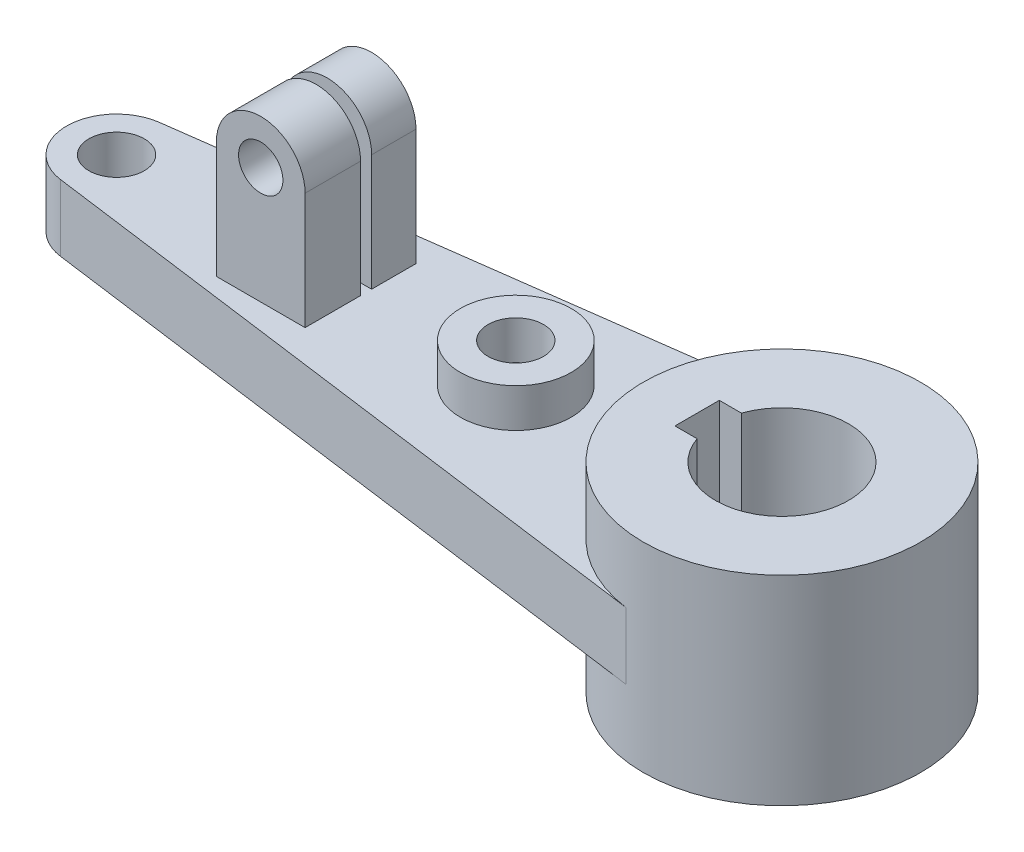
ISO-10303-21;
HEADER;
FILE_DESCRIPTION(('STEP AP214'),'2;1');
FILE_NAME('part.step','',(''),(''),'','','');
FILE_SCHEMA(('AUTOMOTIVE_DESIGN { 1 0 10303 214 1 1 1 1 }'));
ENDSEC;
DATA;
#1=APPLICATION_CONTEXT('core data for automotive mechanical design processes');
#2=APPLICATION_PROTOCOL_DEFINITION('international standard','automotive_design',2000,#1);
#3=PRODUCT_CONTEXT('',#1,'mechanical');
#4=PRODUCT('Part','Part','',(#3));
#5=PRODUCT_RELATED_PRODUCT_CATEGORY('part','',(#4));
#6=PRODUCT_DEFINITION_FORMATION('','',#4);
#7=PRODUCT_DEFINITION_CONTEXT('part definition',#1,'design');
#8=PRODUCT_DEFINITION('design','',#6,#7);
#9=PRODUCT_DEFINITION_SHAPE('','',#8);
#10=(LENGTH_UNIT() NAMED_UNIT(*) SI_UNIT(.MILLI.,.METRE.));
#11=(NAMED_UNIT(*) PLANE_ANGLE_UNIT() SI_UNIT($,.RADIAN.));
#12=(NAMED_UNIT(*) SI_UNIT($,.STERADIAN.) SOLID_ANGLE_UNIT());
#13=UNCERTAINTY_MEASURE_WITH_UNIT(LENGTH_MEASURE(1.E-05),#10,'distance_accuracy_value','');
#14=(GEOMETRIC_REPRESENTATION_CONTEXT(3) GLOBAL_UNCERTAINTY_ASSIGNED_CONTEXT((#13)) GLOBAL_UNIT_ASSIGNED_CONTEXT((#10,
#11,#12)) REPRESENTATION_CONTEXT('',''));
#15=CARTESIAN_POINT('',(0.,0.,0.));
#16=DIRECTION('',(0.,0.,1.));
#17=DIRECTION('',(1.,0.,0.));
#18=AXIS2_PLACEMENT_3D('',#15,#16,#17);
#19=CARTESIAN_POINT('',(-76.,0.,10.));
#20=DIRECTION('',(1.,0.,0.));
#21=DIRECTION('',(0.,0.,-1.));
#22=AXIS2_PLACEMENT_3D('',#19,#20,#21);
#23=PLANE('',#22);
#24=DIRECTION('',(0.,-1.,0.));
#25=VECTOR('',#24,1.);
#26=CARTESIAN_POINT('',(-76.,27.,-2.));
#27=LINE('',#26,#25);
#28=CARTESIAN_POINT('',(-76.,27.,-2.));
#29=VERTEX_POINT('',#28);
#30=CARTESIAN_POINT('',(-76.,6.,-2.));
#31=VERTEX_POINT('',#30);
#32=EDGE_CURVE('E166',#29,#31,#27,.T.);
#33=ORIENTED_EDGE('',*,*,#32,.T.);
#34=DIRECTION('',(0.,0.,-1.));
#35=VECTOR('',#34,1.);
#36=CARTESIAN_POINT('',(-76.,6.,10.));
#37=LINE('',#36,#35);
#38=CARTESIAN_POINT('',(-76.,6.,-10.));
#39=VERTEX_POINT('',#38);
#40=EDGE_CURVE('E71',#31,#39,#37,.T.);
#41=ORIENTED_EDGE('',*,*,#40,.T.);
#42=DIRECTION('',(0.,-1.,0.));
#43=VECTOR('',#42,1.);
#44=CARTESIAN_POINT('',(-76.,0.,-10.));
#45=LINE('',#44,#43);
#46=CARTESIAN_POINT('',(-76.,27.,-10.));
#47=VERTEX_POINT('',#46);
#48=EDGE_CURVE('E355',#47,#39,#45,.T.);
#49=ORIENTED_EDGE('',*,*,#48,.F.);
#50=DIRECTION('',(0.,0.,-1.));
#51=VECTOR('',#50,1.);
#52=CARTESIAN_POINT('',(-76.,27.,10.));
#53=LINE('',#52,#51);
#54=EDGE_CURVE('E174',#29,#47,#53,.T.);
#55=ORIENTED_EDGE('',*,*,#54,.F.);
#56=EDGE_LOOP('',(#33,#41,#49,#55));
#57=FACE_BOUND('',#56,.T.);
#58=ADVANCED_FACE('F45',(#57),#23,.T.);
#59=CARTESIAN_POINT('',(-84.,27.,10.));
#60=DIRECTION('',(0.,0.,-1.));
#61=DIRECTION('',(-1.,0.,0.));
#62=AXIS2_PLACEMENT_3D('',#59,#60,#61);
#63=CYLINDRICAL_SURFACE('',#62,8.);
#64=DIRECTION('',(0.,0.,-1.));
#65=VECTOR('',#64,1.);
#66=CARTESIAN_POINT('',(-92.,27.,10.));
#67=LINE('',#66,#65);
#68=CARTESIAN_POINT('',(-92.,27.,-2.));
#69=VERTEX_POINT('',#68);
#70=CARTESIAN_POINT('',(-92.,27.,-10.));
#71=VERTEX_POINT('',#70);
#72=EDGE_CURVE('E200',#69,#71,#67,.T.);
#73=ORIENTED_EDGE('',*,*,#72,.F.);
#74=CARTESIAN_POINT('',(-84.,27.,-2.));
#75=DIRECTION('',(0.,0.,-1.));
#76=DIRECTION('',(-1.,0.,0.));
#77=AXIS2_PLACEMENT_3D('',#74,#75,#76);
#78=CIRCLE('',#77,8.);
#79=EDGE_CURVE('E334',#69,#29,#78,.T.);
#80=ORIENTED_EDGE('',*,*,#79,.T.);
#81=ORIENTED_EDGE('',*,*,#54,.T.);
#82=CARTESIAN_POINT('',(-84.,27.,-10.));
#83=DIRECTION('',(0.,0.,1.));
#84=DIRECTION('',(1.,0.,0.));
#85=AXIS2_PLACEMENT_3D('',#82,#83,#84);
#86=CIRCLE('',#85,8.);
#87=EDGE_CURVE('E358',#47,#71,#86,.T.);
#88=ORIENTED_EDGE('',*,*,#87,.T.);
#89=EDGE_LOOP('',(#73,#80,#81,#88));
#90=FACE_BOUND('',#89,.T.);
#91=ADVANCED_FACE('F374',(#90),#63,.T.);
#92=CARTESIAN_POINT('',(-92.,0.,10.));
#93=DIRECTION('',(-1.,0.,0.));
#94=DIRECTION('',(0.,0.,1.));
#95=AXIS2_PLACEMENT_3D('',#92,#93,#94);
#96=PLANE('',#95);
#97=DIRECTION('',(0.,-1.,0.));
#98=VECTOR('',#97,1.);
#99=CARTESIAN_POINT('',(-92.,6.,-2.));
#100=LINE('',#99,#98);
#101=CARTESIAN_POINT('',(-92.,6.,-2.));
#102=VERTEX_POINT('',#101);
#103=EDGE_CURVE('E169',#69,#102,#100,.T.);
#104=ORIENTED_EDGE('',*,*,#103,.F.);
#105=ORIENTED_EDGE('',*,*,#72,.T.);
#106=DIRECTION('',(0.,1.,0.));
#107=VECTOR('',#106,1.);
#108=CARTESIAN_POINT('',(-92.,0.,-10.));
#109=LINE('',#108,#107);
#110=CARTESIAN_POINT('',(-92.,6.,-10.));
#111=VERTEX_POINT('',#110);
#112=EDGE_CURVE('E361',#111,#71,#109,.T.);
#113=ORIENTED_EDGE('',*,*,#112,.F.);
#114=DIRECTION('',(0.,0.,-1.));
#115=VECTOR('',#114,1.);
#116=CARTESIAN_POINT('',(-92.,6.,10.));
#117=LINE('',#116,#115);
#118=EDGE_CURVE('E190',#102,#111,#117,.T.);
#119=ORIENTED_EDGE('',*,*,#118,.F.);
#120=EDGE_LOOP('',(#104,#105,#113,#119));
#121=FACE_BOUND('',#120,.T.);
#122=ADVANCED_FACE('F370',(#121),#96,.T.);
#123=CARTESIAN_POINT('',(-84.,27.,10.));
#124=DIRECTION('',(0.,0.,-1.));
#125=DIRECTION('',(-1.,0.,0.));
#126=AXIS2_PLACEMENT_3D('',#123,#124,#125);
#127=CYLINDRICAL_SURFACE('',#126,4.00000000000001);
#128=CARTESIAN_POINT('',(-84.,27.,-2.));
#129=DIRECTION('',(0.,0.,-1.));
#130=DIRECTION('',(-1.,0.,0.));
#131=AXIS2_PLACEMENT_3D('',#128,#129,#130);
#132=CIRCLE('',#131,4.00000000000001);
#133=CARTESIAN_POINT('',(-88.,27.,-2.));
#134=VERTEX_POINT('',#133);
#135=EDGE_CURVE('E49',#134,#134,#132,.T.);
#136=ORIENTED_EDGE('',*,*,#135,.F.);
#137=EDGE_LOOP('',(#136));
#138=FACE_BOUND('',#137,.T.);
#139=CARTESIAN_POINT('',(-84.,27.,-10.));
#140=DIRECTION('',(0.,0.,1.));
#141=DIRECTION('',(1.,0.,0.));
#142=AXIS2_PLACEMENT_3D('',#139,#140,#141);
#143=CIRCLE('',#142,4.00000000000001);
#144=CARTESIAN_POINT('',(-80.,27.,-10.));
#145=VERTEX_POINT('',#144);
#146=EDGE_CURVE('E337',#145,#145,#143,.T.);
#147=ORIENTED_EDGE('',*,*,#146,.F.);
#148=EDGE_LOOP('',(#147));
#149=FACE_BOUND('',#148,.T.);
#150=ADVANCED_FACE('F384',(#138,#149),#127,.F.);
#151=CARTESIAN_POINT('',(0.,18.,0.));
#152=DIRECTION('',(0.,-1.,0.));
#153=DIRECTION('',(0.,0.,-1.));
#154=AXIS2_PLACEMENT_3D('',#151,#152,#153);
#155=CYLINDRICAL_SURFACE('',#154,25.);
#156=CARTESIAN_POINT('',(0.,-18.,0.));
#157=DIRECTION('',(0.,1.,0.));
#158=DIRECTION('',(0.,0.,1.));
#159=AXIS2_PLACEMENT_3D('',#156,#157,#158);
#160=CIRCLE('',#159,25.);
#161=CARTESIAN_POINT('',(0.,-18.,25.));
#162=VERTEX_POINT('',#161);
#163=EDGE_CURVE('E55',#162,#162,#160,.T.);
#164=ORIENTED_EDGE('',*,*,#163,.T.);
#165=EDGE_LOOP('',(#164));
#166=FACE_BOUND('',#165,.T.);
#167=CARTESIAN_POINT('',(0.,18.,0.));
#168=DIRECTION('',(0.,1.,0.));
#169=DIRECTION('',(0.,0.,1.));
#170=AXIS2_PLACEMENT_3D('',#167,#168,#169);
#171=CIRCLE('',#170,25.);
#172=CARTESIAN_POINT('',(0.,18.,25.));
#173=VERTEX_POINT('',#172);
#174=EDGE_CURVE('E11',#173,#173,#171,.T.);
#175=ORIENTED_EDGE('',*,*,#174,.F.);
#176=EDGE_LOOP('',(#175));
#177=FACE_BOUND('',#176,.T.);
#178=DIRECTION('',(0.,-1.,0.));
#179=VECTOR('',#178,1.);
#180=CARTESIAN_POINT('',(-3.33333333333334,6.,-24.7767812455308));
#181=LINE('',#180,#179);
#182=CARTESIAN_POINT('',(-3.33333333333334,6.,-24.7767812455308));
#183=VERTEX_POINT('',#182);
#184=CARTESIAN_POINT('',(-3.33333333333334,-6.,-24.7767812455308));
#185=VERTEX_POINT('',#184);
#186=EDGE_CURVE('E272',#183,#185,#181,.T.);
#187=ORIENTED_EDGE('',*,*,#186,.F.);
#188=CARTESIAN_POINT('',(0.,6.,0.));
#189=DIRECTION('',(0.,-1.,0.));
#190=DIRECTION('',(0.,0.,1.));
#191=AXIS2_PLACEMENT_3D('',#188,#189,#190);
#192=CIRCLE('',#191,25.);
#193=CARTESIAN_POINT('',(-3.33333333333333,6.,24.7767812455308));
#194=VERTEX_POINT('',#193);
#195=EDGE_CURVE('E234',#194,#183,#192,.T.);
#196=ORIENTED_EDGE('',*,*,#195,.F.);
#197=DIRECTION('',(0.,-1.,0.));
#198=VECTOR('',#197,1.);
#199=CARTESIAN_POINT('',(-3.33333333333333,6.,24.7767812455308));
#200=LINE('',#199,#198);
#201=CARTESIAN_POINT('',(-3.33333333333333,-6.,24.7767812455308));
#202=VERTEX_POINT('',#201);
#203=EDGE_CURVE('E248',#194,#202,#200,.T.);
#204=ORIENTED_EDGE('',*,*,#203,.T.);
#205=CARTESIAN_POINT('',(0.,-6.,0.));
#206=DIRECTION('',(0.,-1.,0.));
#207=DIRECTION('',(0.,0.,1.));
#208=AXIS2_PLACEMENT_3D('',#205,#206,#207);
#209=CIRCLE('',#208,25.);
#210=EDGE_CURVE('E230',#202,#185,#209,.T.);
#211=ORIENTED_EDGE('',*,*,#210,.T.);
#212=EDGE_LOOP('',(#187,#196,#204,#211));
#213=FACE_BOUND('',#212,.T.);
#214=ADVANCED_FACE('F47',(#166,#177,#213),#155,.T.);
#215=CARTESIAN_POINT('',(0.,18.,0.));
#216=DIRECTION('',(0.,1.,0.));
#217=DIRECTION('',(0.,0.,1.));
#218=AXIS2_PLACEMENT_3D('',#215,#216,#217);
#219=PLANE('',#218);
#220=ORIENTED_EDGE('',*,*,#174,.T.);
#221=EDGE_LOOP('',(#220));
#222=FACE_BOUND('',#221,.T.);
#223=DIRECTION('',(1.,0.,0.));
#224=VECTOR('',#223,1.);
#225=CARTESIAN_POINT('',(-15.3,18.,4.));
#226=LINE('',#225,#224);
#227=CARTESIAN_POINT('',(-15.3,18.,4.));
#228=VERTEX_POINT('',#227);
#229=CARTESIAN_POINT('',(-11.3137084989848,18.,4.));
#230=VERTEX_POINT('',#229);
#231=EDGE_CURVE('E280',#228,#230,#226,.T.);
#232=ORIENTED_EDGE('',*,*,#231,.F.);
#233=DIRECTION('',(0.,0.,1.));
#234=VECTOR('',#233,1.);
#235=CARTESIAN_POINT('',(-15.3,18.,-4.));
#236=LINE('',#235,#234);
#237=CARTESIAN_POINT('',(-15.3,18.,-4.));
#238=VERTEX_POINT('',#237);
#239=EDGE_CURVE('E277',#238,#228,#236,.T.);
#240=ORIENTED_EDGE('',*,*,#239,.F.);
#241=DIRECTION('',(-1.,0.,0.));
#242=VECTOR('',#241,1.);
#243=CARTESIAN_POINT('',(-15.3,18.,-4.));
#244=LINE('',#243,#242);
#245=CARTESIAN_POINT('',(-11.3137084989848,18.,-4.));
#246=VERTEX_POINT('',#245);
#247=EDGE_CURVE('E288',#246,#238,#244,.T.);
#248=ORIENTED_EDGE('',*,*,#247,.F.);
#249=CARTESIAN_POINT('',(0.,18.,0.));
#250=DIRECTION('',(0.,1.,0.));
#251=DIRECTION('',(0.,0.,1.));
#252=AXIS2_PLACEMENT_3D('',#249,#250,#251);
#253=CIRCLE('',#252,12.);
#254=EDGE_CURVE('E284',#230,#246,#253,.T.);
#255=ORIENTED_EDGE('',*,*,#254,.F.);
#256=EDGE_LOOP('',(#232,#240,#248,#255));
#257=FACE_BOUND('',#256,.T.);
#258=ADVANCED_FACE('F456',(#222,#257),#219,.T.);
#259=CARTESIAN_POINT('',(0.,-18.,0.));
#260=DIRECTION('',(0.,1.,0.));
#261=DIRECTION('',(0.,0.,1.));
#262=AXIS2_PLACEMENT_3D('',#259,#260,#261);
#263=PLANE('',#262);
#264=ORIENTED_EDGE('',*,*,#163,.F.);
#265=EDGE_LOOP('',(#264));
#266=FACE_BOUND('',#265,.T.);
#267=DIRECTION('',(0.,0.,1.));
#268=VECTOR('',#267,1.);
#269=CARTESIAN_POINT('',(-15.3,-18.,-4.));
#270=LINE('',#269,#268);
#271=CARTESIAN_POINT('',(-15.3,-18.,-4.));
#272=VERTEX_POINT('',#271);
#273=CARTESIAN_POINT('',(-15.3,-18.,4.));
#274=VERTEX_POINT('',#273);
#275=EDGE_CURVE('E276',#272,#274,#270,.T.);
#276=ORIENTED_EDGE('',*,*,#275,.T.);
#277=DIRECTION('',(1.,0.,0.));
#278=VECTOR('',#277,1.);
#279=CARTESIAN_POINT('',(-15.3,-18.,4.));
#280=LINE('',#279,#278);
#281=CARTESIAN_POINT('',(-11.3137084989848,-18.,4.));
#282=VERTEX_POINT('',#281);
#283=EDGE_CURVE('E295',#274,#282,#280,.T.);
#284=ORIENTED_EDGE('',*,*,#283,.T.);
#285=CARTESIAN_POINT('',(0.,-18.,0.));
#286=DIRECTION('',(0.,1.,0.));
#287=DIRECTION('',(0.,0.,1.));
#288=AXIS2_PLACEMENT_3D('',#285,#286,#287);
#289=CIRCLE('',#288,12.);
#290=CARTESIAN_POINT('',(-11.3137084989848,-18.,-4.));
#291=VERTEX_POINT('',#290);
#292=EDGE_CURVE('E299',#282,#291,#289,.T.);
#293=ORIENTED_EDGE('',*,*,#292,.T.);
#294=DIRECTION('',(-1.,0.,0.));
#295=VECTOR('',#294,1.);
#296=CARTESIAN_POINT('',(-15.3,-18.,-4.));
#297=LINE('',#296,#295);
#298=EDGE_CURVE('E281',#291,#272,#297,.T.);
#299=ORIENTED_EDGE('',*,*,#298,.T.);
#300=EDGE_LOOP('',(#276,#284,#293,#299));
#301=FACE_BOUND('',#300,.T.);
#302=ADVANCED_FACE('F454',(#266,#301),#263,.F.);
#303=CARTESIAN_POINT('',(-15.3,18.,-4.));
#304=DIRECTION('',(1.,0.,0.));
#305=DIRECTION('',(0.,0.,-1.));
#306=AXIS2_PLACEMENT_3D('',#303,#304,#305);
#307=PLANE('',#306);
#308=ORIENTED_EDGE('',*,*,#275,.F.);
#309=DIRECTION('',(0.,-1.,0.));
#310=VECTOR('',#309,1.);
#311=CARTESIAN_POINT('',(-15.3,18.,-4.));
#312=LINE('',#311,#310);
#313=EDGE_CURVE('E291',#238,#272,#312,.T.);
#314=ORIENTED_EDGE('',*,*,#313,.F.);
#315=ORIENTED_EDGE('',*,*,#239,.T.);
#316=DIRECTION('',(0.,-1.,0.));
#317=VECTOR('',#316,1.);
#318=CARTESIAN_POINT('',(-15.3,18.,4.));
#319=LINE('',#318,#317);
#320=EDGE_CURVE('E315',#228,#274,#319,.T.);
#321=ORIENTED_EDGE('',*,*,#320,.T.);
#322=EDGE_LOOP('',(#308,#314,#315,#321));
#323=FACE_BOUND('',#322,.T.);
#324=ADVANCED_FACE('F450',(#323),#307,.T.);
#325=CARTESIAN_POINT('',(-15.3,18.,4.));
#326=DIRECTION('',(0.,0.,-1.));
#327=DIRECTION('',(-1.,0.,0.));
#328=AXIS2_PLACEMENT_3D('',#325,#326,#327);
#329=PLANE('',#328);
#330=ORIENTED_EDGE('',*,*,#283,.F.);
#331=ORIENTED_EDGE('',*,*,#320,.F.);
#332=ORIENTED_EDGE('',*,*,#231,.T.);
#333=DIRECTION('',(0.,-1.,0.));
#334=VECTOR('',#333,1.);
#335=CARTESIAN_POINT('',(-11.3137084989848,18.,4.));
#336=LINE('',#335,#334);
#337=EDGE_CURVE('E312',#230,#282,#336,.T.);
#338=ORIENTED_EDGE('',*,*,#337,.T.);
#339=EDGE_LOOP('',(#330,#331,#332,#338));
#340=FACE_BOUND('',#339,.T.);
#341=ADVANCED_FACE('F446',(#340),#329,.T.);
#342=CARTESIAN_POINT('',(0.,18.,0.));
#343=DIRECTION('',(0.,-1.,0.));
#344=DIRECTION('',(0.,0.,-1.));
#345=AXIS2_PLACEMENT_3D('',#342,#343,#344);
#346=CYLINDRICAL_SURFACE('',#345,12.);
#347=ORIENTED_EDGE('',*,*,#292,.F.);
#348=ORIENTED_EDGE('',*,*,#337,.F.);
#349=ORIENTED_EDGE('',*,*,#254,.T.);
#350=DIRECTION('',(0.,-1.,0.));
#351=VECTOR('',#350,1.);
#352=CARTESIAN_POINT('',(-11.3137084989848,18.,-4.));
#353=LINE('',#352,#351);
#354=EDGE_CURVE('E309',#246,#291,#353,.T.);
#355=ORIENTED_EDGE('',*,*,#354,.T.);
#356=EDGE_LOOP('',(#347,#348,#349,#355));
#357=FACE_BOUND('',#356,.T.);
#358=ADVANCED_FACE('F426',(#357),#346,.F.);
#359=CARTESIAN_POINT('',(-15.3,18.,-4.));
#360=DIRECTION('',(0.,0.,1.));
#361=DIRECTION('',(1.,0.,0.));
#362=AXIS2_PLACEMENT_3D('',#359,#360,#361);
#363=PLANE('',#362);
#364=ORIENTED_EDGE('',*,*,#298,.F.);
#365=ORIENTED_EDGE('',*,*,#354,.F.);
#366=ORIENTED_EDGE('',*,*,#247,.T.);
#367=ORIENTED_EDGE('',*,*,#313,.T.);
#368=EDGE_LOOP('',(#364,#365,#366,#367));
#369=FACE_BOUND('',#368,.T.);
#370=ADVANCED_FACE('F417',(#369),#363,.T.);
#371=CARTESIAN_POINT('',(0.,6.,0.));
#372=DIRECTION('',(0.,1.,0.));
#373=DIRECTION('',(0.,0.,1.));
#374=AXIS2_PLACEMENT_3D('',#371,#372,#373);
#375=PLANE('',#374);
#376=DIRECTION('',(-1.,0.,0.));
#377=VECTOR('',#376,1.);
#378=CARTESIAN_POINT('',(-76.,6.,0.));
#379=LINE('',#378,#377);
#380=CARTESIAN_POINT('',(-76.,6.,0.));
#381=VERTEX_POINT('',#380);
#382=CARTESIAN_POINT('',(-92.,6.,0.));
#383=VERTEX_POINT('',#382);
#384=EDGE_CURVE('E63',#381,#383,#379,.T.);
#385=ORIENTED_EDGE('',*,*,#384,.F.);
#386=CARTESIAN_POINT('',(-76.,6.,10.));
#387=VERTEX_POINT('',#386);
#388=EDGE_CURVE('E184',#387,#381,#37,.T.);
#389=ORIENTED_EDGE('',*,*,#388,.F.);
#390=DIRECTION('',(1.,0.,0.));
#391=VECTOR('',#390,1.);
#392=CARTESIAN_POINT('',(0.,6.,10.));
#393=LINE('',#392,#391);
#394=CARTESIAN_POINT('',(-92.,6.,10.));
#395=VERTEX_POINT('',#394);
#396=EDGE_CURVE('E185',#395,#387,#393,.T.);
#397=ORIENTED_EDGE('',*,*,#396,.F.);
#398=EDGE_CURVE('E196',#395,#383,#117,.T.);
#399=ORIENTED_EDGE('',*,*,#398,.T.);
#400=EDGE_LOOP('',(#385,#389,#397,#399));
#401=FACE_BOUND('',#400,.T.);
#402=ORIENTED_EDGE('',*,*,#40,.F.);
#403=DIRECTION('',(-1.,0.,0.));
#404=VECTOR('',#403,1.);
#405=CARTESIAN_POINT('',(-76.,6.,-2.));
#406=LINE('',#405,#404);
#407=EDGE_CURVE('E164',#31,#102,#406,.T.);
#408=ORIENTED_EDGE('',*,*,#407,.T.);
#409=ORIENTED_EDGE('',*,*,#118,.T.);
#410=DIRECTION('',(1.,0.,0.));
#411=VECTOR('',#410,1.);
#412=CARTESIAN_POINT('',(0.,6.,-10.));
#413=LINE('',#412,#411);
#414=EDGE_CURVE('E182',#111,#39,#413,.T.);
#415=ORIENTED_EDGE('',*,*,#414,.T.);
#416=EDGE_LOOP('',(#402,#408,#409,#415));
#417=FACE_BOUND('',#416,.T.);
#418=CARTESIAN_POINT('',(-48.,6.,0.));
#419=DIRECTION('',(0.,1.,0.));
#420=DIRECTION('',(0.,0.,1.));
#421=AXIS2_PLACEMENT_3D('',#418,#419,#420);
#422=CIRCLE('',#421,10.);
#423=CARTESIAN_POINT('',(-48.,6.,10.));
#424=VERTEX_POINT('',#423);
#425=EDGE_CURVE('E214',#424,#424,#422,.T.);
#426=ORIENTED_EDGE('',*,*,#425,.F.);
#427=EDGE_LOOP('',(#426));
#428=FACE_BOUND('',#427,.T.);
#429=ORIENTED_EDGE('',*,*,#195,.T.);
#430=DIRECTION('',(-0.991071249821234,0.,0.133333333333334));
#431=VECTOR('',#430,1.);
#432=CARTESIAN_POINT('',(-121.2,6.,-8.91964124839108));
#433=LINE('',#432,#431);
#434=CARTESIAN_POINT('',(-121.2,6.,-8.91964124839108));
#435=VERTEX_POINT('',#434);
#436=EDGE_CURVE('E238',#183,#435,#433,.T.);
#437=ORIENTED_EDGE('',*,*,#436,.T.);
#438=CARTESIAN_POINT('',(-120.,6.,0.));
#439=DIRECTION('',(0.,1.,0.));
#440=DIRECTION('',(0.,0.,1.));
#441=AXIS2_PLACEMENT_3D('',#438,#439,#440);
#442=CIRCLE('',#441,9.);
#443=CARTESIAN_POINT('',(-121.2,6.,8.91964124839111));
#444=VERTEX_POINT('',#443);
#445=EDGE_CURVE('E242',#435,#444,#442,.T.);
#446=ORIENTED_EDGE('',*,*,#445,.T.);
#447=DIRECTION('',(0.991071249821234,0.,0.133333333333333));
#448=VECTOR('',#447,1.);
#449=CARTESIAN_POINT('',(-121.2,6.,8.91964124839112));
#450=LINE('',#449,#448);
#451=EDGE_CURVE('E245',#444,#194,#450,.T.);
#452=ORIENTED_EDGE('',*,*,#451,.T.);
#453=EDGE_LOOP('',(#429,#437,#446,#452));
#454=FACE_BOUND('',#453,.T.);
#455=CARTESIAN_POINT('',(-120.,6.,0.));
#456=DIRECTION('',(0.,1.,0.));
#457=DIRECTION('',(0.,0.,1.));
#458=AXIS2_PLACEMENT_3D('',#455,#456,#457);
#459=CIRCLE('',#458,5.);
#460=CARTESIAN_POINT('',(-120.,6.,5.00000000000002));
#461=VERTEX_POINT('',#460);
#462=EDGE_CURVE('E226',#461,#461,#459,.T.);
#463=ORIENTED_EDGE('',*,*,#462,.F.);
#464=EDGE_LOOP('',(#463));
#465=FACE_BOUND('',#464,.T.);
#466=ADVANCED_FACE('F179',(#401,#417,#428,#454,#465),#375,.T.);
#467=CARTESIAN_POINT('',(0.,-6.,0.));
#468=DIRECTION('',(0.,1.,0.));
#469=DIRECTION('',(0.,0.,1.));
#470=AXIS2_PLACEMENT_3D('',#467,#468,#469);
#471=PLANE('',#470);
#472=ORIENTED_EDGE('',*,*,#210,.F.);
#473=DIRECTION('',(0.991071249821234,0.,0.133333333333333));
#474=VECTOR('',#473,1.);
#475=CARTESIAN_POINT('',(-121.2,-6.,8.91964124839112));
#476=LINE('',#475,#474);
#477=CARTESIAN_POINT('',(-121.2,-6.,8.91964124839111));
#478=VERTEX_POINT('',#477);
#479=EDGE_CURVE('E239',#478,#202,#476,.T.);
#480=ORIENTED_EDGE('',*,*,#479,.F.);
#481=CARTESIAN_POINT('',(-120.,-6.,0.));
#482=DIRECTION('',(0.,1.,0.));
#483=DIRECTION('',(0.,0.,1.));
#484=AXIS2_PLACEMENT_3D('',#481,#482,#483);
#485=CIRCLE('',#484,9.);
#486=CARTESIAN_POINT('',(-121.2,-6.,-8.91964124839108));
#487=VERTEX_POINT('',#486);
#488=EDGE_CURVE('E255',#487,#478,#485,.T.);
#489=ORIENTED_EDGE('',*,*,#488,.F.);
#490=DIRECTION('',(-0.991071249821234,0.,0.133333333333334));
#491=VECTOR('',#490,1.);
#492=CARTESIAN_POINT('',(-121.2,-6.,-8.91964124839108));
#493=LINE('',#492,#491);
#494=EDGE_CURVE('E252',#185,#487,#493,.T.);
#495=ORIENTED_EDGE('',*,*,#494,.F.);
#496=EDGE_LOOP('',(#472,#480,#489,#495));
#497=FACE_BOUND('',#496,.T.);
#498=CARTESIAN_POINT('',(-120.,-6.,0.));
#499=DIRECTION('',(0.,1.,0.));
#500=DIRECTION('',(0.,0.,1.));
#501=AXIS2_PLACEMENT_3D('',#498,#499,#500);
#502=CIRCLE('',#501,5.);
#503=CARTESIAN_POINT('',(-120.,-6.,5.00000000000002));
#504=VERTEX_POINT('',#503);
#505=EDGE_CURVE('E222',#504,#504,#502,.T.);
#506=ORIENTED_EDGE('',*,*,#505,.T.);
#507=EDGE_LOOP('',(#506));
#508=FACE_BOUND('',#507,.T.);
#509=ADVANCED_FACE('F416',(#497,#508),#471,.F.);
#510=CARTESIAN_POINT('',(-121.2,6.,-8.91964124839108));
#511=DIRECTION('',(0.133333333333334,0.,0.991071249821234));
#512=DIRECTION('',(0.991071249821234,0.,-0.133333333333334));
#513=AXIS2_PLACEMENT_3D('',#510,#511,#512);
#514=PLANE('',#513);
#515=ORIENTED_EDGE('',*,*,#494,.T.);
#516=DIRECTION('',(0.,-1.,0.));
#517=VECTOR('',#516,1.);
#518=CARTESIAN_POINT('',(-121.2,6.,-8.91964124839108));
#519=LINE('',#518,#517);
#520=EDGE_CURVE('E268',#435,#487,#519,.T.);
#521=ORIENTED_EDGE('',*,*,#520,.F.);
#522=ORIENTED_EDGE('',*,*,#436,.F.);
#523=ORIENTED_EDGE('',*,*,#186,.T.);
#524=EDGE_LOOP('',(#515,#521,#522,#523));
#525=FACE_BOUND('',#524,.T.);
#526=ADVANCED_FACE('F423',(#525),#514,.F.);
#527=CARTESIAN_POINT('',(-120.,6.,0.));
#528=DIRECTION('',(0.,-1.,0.));
#529=DIRECTION('',(0.,0.,-1.));
#530=AXIS2_PLACEMENT_3D('',#527,#528,#529);
#531=CYLINDRICAL_SURFACE('',#530,9.);
#532=ORIENTED_EDGE('',*,*,#488,.T.);
#533=DIRECTION('',(0.,-1.,0.));
#534=VECTOR('',#533,1.);
#535=CARTESIAN_POINT('',(-121.2,6.,8.91964124839111));
#536=LINE('',#535,#534);
#537=EDGE_CURVE('E264',#444,#478,#536,.T.);
#538=ORIENTED_EDGE('',*,*,#537,.F.);
#539=ORIENTED_EDGE('',*,*,#445,.F.);
#540=ORIENTED_EDGE('',*,*,#520,.T.);
#541=EDGE_LOOP('',(#532,#538,#539,#540));
#542=FACE_BOUND('',#541,.T.);
#543=ADVANCED_FACE('F436',(#542),#531,.T.);
#544=CARTESIAN_POINT('',(-121.2,6.,8.91964124839112));
#545=DIRECTION('',(0.133333333333333,0.,-0.991071249821234));
#546=DIRECTION('',(-0.991071249821234,0.,-0.133333333333333));
#547=AXIS2_PLACEMENT_3D('',#544,#545,#546);
#548=PLANE('',#547);
#549=ORIENTED_EDGE('',*,*,#479,.T.);
#550=ORIENTED_EDGE('',*,*,#203,.F.);
#551=ORIENTED_EDGE('',*,*,#451,.F.);
#552=ORIENTED_EDGE('',*,*,#537,.T.);
#553=EDGE_LOOP('',(#549,#550,#551,#552));
#554=FACE_BOUND('',#553,.T.);
#555=ADVANCED_FACE('F433',(#554),#548,.F.);
#556=CARTESIAN_POINT('',(-120.,6.,0.));
#557=DIRECTION('',(0.,-1.,0.));
#558=DIRECTION('',(0.,0.,-1.));
#559=AXIS2_PLACEMENT_3D('',#556,#557,#558);
#560=CYLINDRICAL_SURFACE('',#559,5.);
#561=ORIENTED_EDGE('',*,*,#462,.T.);
#562=EDGE_LOOP('',(#561));
#563=FACE_BOUND('',#562,.T.);
#564=ORIENTED_EDGE('',*,*,#505,.F.);
#565=EDGE_LOOP('',(#564));
#566=FACE_BOUND('',#565,.T.);
#567=ADVANCED_FACE('F430',(#563,#566),#560,.F.);
#568=CARTESIAN_POINT('',(-48.,13.,0.));
#569=DIRECTION('',(0.,-1.,0.));
#570=DIRECTION('',(0.,0.,-1.));
#571=AXIS2_PLACEMENT_3D('',#568,#569,#570);
#572=CYLINDRICAL_SURFACE('',#571,10.);
#573=CARTESIAN_POINT('',(-48.,13.,0.));
#574=DIRECTION('',(0.,1.,0.));
#575=DIRECTION('',(0.,0.,1.));
#576=AXIS2_PLACEMENT_3D('',#573,#574,#575);
#577=CIRCLE('',#576,10.);
#578=CARTESIAN_POINT('',(-48.,13.,10.));
#579=VERTEX_POINT('',#578);
#580=EDGE_CURVE('E218',#579,#579,#577,.T.);
#581=ORIENTED_EDGE('',*,*,#580,.F.);
#582=EDGE_LOOP('',(#581));
#583=FACE_BOUND('',#582,.T.);
#584=ORIENTED_EDGE('',*,*,#425,.T.);
#585=EDGE_LOOP('',(#584));
#586=FACE_BOUND('',#585,.T.);
#587=ADVANCED_FACE('F495',(#583,#586),#572,.T.);
#588=CARTESIAN_POINT('',(-48.,13.,0.));
#589=DIRECTION('',(0.,1.,0.));
#590=DIRECTION('',(0.,0.,1.));
#591=AXIS2_PLACEMENT_3D('',#588,#589,#590);
#592=PLANE('',#591);
#593=CARTESIAN_POINT('',(-48.,13.,0.));
#594=DIRECTION('',(0.,1.,0.));
#595=DIRECTION('',(0.,0.,1.));
#596=AXIS2_PLACEMENT_3D('',#593,#594,#595);
#597=CIRCLE('',#596,5.);
#598=CARTESIAN_POINT('',(-48.,13.,5.));
#599=VERTEX_POINT('',#598);
#600=EDGE_CURVE('E209',#599,#599,#597,.T.);
#601=ORIENTED_EDGE('',*,*,#600,.F.);
#602=EDGE_LOOP('',(#601));
#603=FACE_BOUND('',#602,.T.);
#604=ORIENTED_EDGE('',*,*,#580,.T.);
#605=EDGE_LOOP('',(#604));
#606=FACE_BOUND('',#605,.T.);
#607=ADVANCED_FACE('F500',(#603,#606),#592,.T.);
#608=CARTESIAN_POINT('',(-48.,6.,0.));
#609=DIRECTION('',(0.,1.,0.));
#610=DIRECTION('',(0.,0.,1.));
#611=AXIS2_PLACEMENT_3D('',#608,#609,#610);
#612=CYLINDRICAL_SURFACE('',#611,5.);
#613=CARTESIAN_POINT('',(-48.,6.,0.));
#614=DIRECTION('',(0.,1.,0.));
#615=DIRECTION('',(0.,0.,1.));
#616=AXIS2_PLACEMENT_3D('',#613,#614,#615);
#617=CIRCLE('',#616,5.);
#618=CARTESIAN_POINT('',(-48.,6.,5.));
#619=VERTEX_POINT('',#618);
#620=EDGE_CURVE('E210',#619,#619,#617,.T.);
#621=ORIENTED_EDGE('',*,*,#620,.F.);
#622=EDGE_LOOP('',(#621));
#623=FACE_BOUND('',#622,.T.);
#624=ORIENTED_EDGE('',*,*,#600,.T.);
#625=EDGE_LOOP('',(#624));
#626=FACE_BOUND('',#625,.T.);
#627=ADVANCED_FACE('F506',(#623,#626),#612,.F.);
#628=CARTESIAN_POINT('',(-48.,6.,0.));
#629=DIRECTION('',(0.,1.,0.));
#630=DIRECTION('',(0.,0.,1.));
#631=AXIS2_PLACEMENT_3D('',#628,#629,#630);
#632=PLANE('',#631);
#633=ORIENTED_EDGE('',*,*,#620,.T.);
#634=EDGE_LOOP('',(#633));
#635=FACE_BOUND('',#634,.T.);
#636=ADVANCED_FACE('F397',(#635),#632,.T.);
#637=DIRECTION('',(0.,1.,0.));
#638=VECTOR('',#637,1.);
#639=CARTESIAN_POINT('',(-76.,6.,0.));
#640=LINE('',#639,#638);
#641=CARTESIAN_POINT('',(-76.,27.,0.));
#642=VERTEX_POINT('',#641);
#643=EDGE_CURVE('E176',#381,#642,#640,.T.);
#644=ORIENTED_EDGE('',*,*,#643,.T.);
#645=CARTESIAN_POINT('',(-76.,27.,10.));
#646=VERTEX_POINT('',#645);
#647=EDGE_CURVE('E205',#646,#642,#53,.T.);
#648=ORIENTED_EDGE('',*,*,#647,.F.);
#649=DIRECTION('',(0.,-1.,0.));
#650=VECTOR('',#649,1.);
#651=CARTESIAN_POINT('',(-76.,0.,10.));
#652=LINE('',#651,#650);
#653=EDGE_CURVE('E342',#646,#387,#652,.T.);
#654=ORIENTED_EDGE('',*,*,#653,.T.);
#655=ORIENTED_EDGE('',*,*,#388,.T.);
#656=EDGE_LOOP('',(#644,#648,#654,#655));
#657=FACE_BOUND('',#656,.T.);
#658=ADVANCED_FACE('F388',(#657),#23,.T.);
#659=ORIENTED_EDGE('',*,*,#647,.T.);
#660=CARTESIAN_POINT('',(-84.,27.,0.));
#661=DIRECTION('',(0.,0.,1.));
#662=DIRECTION('',(1.,0.,0.));
#663=AXIS2_PLACEMENT_3D('',#660,#661,#662);
#664=CIRCLE('',#663,8.);
#665=CARTESIAN_POINT('',(-92.,27.,0.));
#666=VERTEX_POINT('',#665);
#667=EDGE_CURVE('E324',#642,#666,#664,.T.);
#668=ORIENTED_EDGE('',*,*,#667,.T.);
#669=CARTESIAN_POINT('',(-92.,27.,10.));
#670=VERTEX_POINT('',#669);
#671=EDGE_CURVE('E201',#670,#666,#67,.T.);
#672=ORIENTED_EDGE('',*,*,#671,.F.);
#673=CARTESIAN_POINT('',(-84.,27.,10.));
#674=DIRECTION('',(0.,0.,1.));
#675=DIRECTION('',(1.,0.,0.));
#676=AXIS2_PLACEMENT_3D('',#673,#674,#675);
#677=CIRCLE('',#676,8.);
#678=EDGE_CURVE('E346',#646,#670,#677,.T.);
#679=ORIENTED_EDGE('',*,*,#678,.F.);
#680=EDGE_LOOP('',(#659,#668,#672,#679));
#681=FACE_BOUND('',#680,.T.);
#682=ADVANCED_FACE('F379',(#681),#63,.T.);
#683=DIRECTION('',(0.,1.,0.));
#684=VECTOR('',#683,1.);
#685=CARTESIAN_POINT('',(-92.,27.,0.));
#686=LINE('',#685,#684);
#687=EDGE_CURVE('E407',#383,#666,#686,.T.);
#688=ORIENTED_EDGE('',*,*,#687,.F.);
#689=ORIENTED_EDGE('',*,*,#398,.F.);
#690=DIRECTION('',(0.,1.,0.));
#691=VECTOR('',#690,1.);
#692=CARTESIAN_POINT('',(-92.,0.,10.));
#693=LINE('',#692,#691);
#694=EDGE_CURVE('E191',#395,#670,#693,.T.);
#695=ORIENTED_EDGE('',*,*,#694,.T.);
#696=ORIENTED_EDGE('',*,*,#671,.T.);
#697=EDGE_LOOP('',(#688,#689,#695,#696));
#698=FACE_BOUND('',#697,.T.);
#699=ADVANCED_FACE('F386',(#698),#96,.T.);
#700=CARTESIAN_POINT('',(-84.,27.,0.));
#701=DIRECTION('',(0.,0.,1.));
#702=DIRECTION('',(1.,0.,0.));
#703=AXIS2_PLACEMENT_3D('',#700,#701,#702);
#704=CIRCLE('',#703,4.00000000000001);
#705=CARTESIAN_POINT('',(-80.,27.,0.));
#706=VERTEX_POINT('',#705);
#707=EDGE_CURVE('E321',#706,#706,#704,.T.);
#708=ORIENTED_EDGE('',*,*,#707,.F.);
#709=EDGE_LOOP('',(#708));
#710=FACE_BOUND('',#709,.T.);
#711=CARTESIAN_POINT('',(-84.,27.,10.));
#712=DIRECTION('',(0.,0.,1.));
#713=DIRECTION('',(1.,0.,0.));
#714=AXIS2_PLACEMENT_3D('',#711,#712,#713);
#715=CIRCLE('',#714,4.00000000000001);
#716=CARTESIAN_POINT('',(-80.,27.,10.));
#717=VERTEX_POINT('',#716);
#718=EDGE_CURVE('E338',#717,#717,#715,.T.);
#719=ORIENTED_EDGE('',*,*,#718,.T.);
#720=EDGE_LOOP('',(#719));
#721=FACE_BOUND('',#720,.T.);
#722=ADVANCED_FACE('F395',(#710,#721),#127,.F.);
#723=CARTESIAN_POINT('',(0.,0.,10.));
#724=DIRECTION('',(0.,0.,1.));
#725=DIRECTION('',(1.,0.,0.));
#726=AXIS2_PLACEMENT_3D('',#723,#724,#725);
#727=PLANE('',#726);
#728=ORIENTED_EDGE('',*,*,#718,.F.);
#729=EDGE_LOOP('',(#728));
#730=FACE_BOUND('',#729,.T.);
#731=ORIENTED_EDGE('',*,*,#653,.F.);
#732=ORIENTED_EDGE('',*,*,#678,.T.);
#733=ORIENTED_EDGE('',*,*,#694,.F.);
#734=ORIENTED_EDGE('',*,*,#396,.T.);
#735=EDGE_LOOP('',(#731,#732,#733,#734));
#736=FACE_BOUND('',#735,.T.);
#737=ADVANCED_FACE('F413',(#730,#736),#727,.T.);
#738=CARTESIAN_POINT('',(0.,0.,-10.));
#739=DIRECTION('',(0.,0.,1.));
#740=DIRECTION('',(1.,0.,0.));
#741=AXIS2_PLACEMENT_3D('',#738,#739,#740);
#742=PLANE('',#741);
#743=ORIENTED_EDGE('',*,*,#146,.T.);
#744=EDGE_LOOP('',(#743));
#745=FACE_BOUND('',#744,.T.);
#746=ORIENTED_EDGE('',*,*,#48,.T.);
#747=ORIENTED_EDGE('',*,*,#414,.F.);
#748=ORIENTED_EDGE('',*,*,#112,.T.);
#749=ORIENTED_EDGE('',*,*,#87,.F.);
#750=EDGE_LOOP('',(#746,#747,#748,#749));
#751=FACE_BOUND('',#750,.T.);
#752=ADVANCED_FACE('F368',(#745,#751),#742,.F.);
#753=CARTESIAN_POINT('',(-76.,6.,-2.));
#754=DIRECTION('',(0.,0.,-1.));
#755=DIRECTION('',(-1.,0.,0.));
#756=AXIS2_PLACEMENT_3D('',#753,#754,#755);
#757=PLANE('',#756);
#758=ORIENTED_EDGE('',*,*,#135,.T.);
#759=EDGE_LOOP('',(#758));
#760=FACE_BOUND('',#759,.T.);
#761=ORIENTED_EDGE('',*,*,#103,.T.);
#762=ORIENTED_EDGE('',*,*,#407,.F.);
#763=ORIENTED_EDGE('',*,*,#32,.F.);
#764=ORIENTED_EDGE('',*,*,#79,.F.);
#765=EDGE_LOOP('',(#761,#762,#763,#764));
#766=FACE_BOUND('',#765,.T.);
#767=ADVANCED_FACE('F165',(#760,#766),#757,.F.);
#768=CARTESIAN_POINT('',(-76.,27.,0.));
#769=DIRECTION('',(0.,0.,1.));
#770=DIRECTION('',(1.,0.,0.));
#771=AXIS2_PLACEMENT_3D('',#768,#769,#770);
#772=PLANE('',#771);
#773=ORIENTED_EDGE('',*,*,#707,.T.);
#774=EDGE_LOOP('',(#773));
#775=FACE_BOUND('',#774,.T.);
#776=ORIENTED_EDGE('',*,*,#643,.F.);
#777=ORIENTED_EDGE('',*,*,#384,.T.);
#778=ORIENTED_EDGE('',*,*,#687,.T.);
#779=ORIENTED_EDGE('',*,*,#667,.F.);
#780=EDGE_LOOP('',(#776,#777,#778,#779));
#781=FACE_BOUND('',#780,.T.);
#782=ADVANCED_FACE('F409',(#775,#781),#772,.F.);
#783=CLOSED_SHELL('',(#58,#91,#122,#150,#214,#258,#302,#324,#341,#358,#370,#466,#509,#526,#543,
#555,#567,#587,#607,#627,#636,#658,#682,#699,#722,#737,#752,#767,#782));
#784=MANIFOLD_SOLID_BREP('B2',#783);
#785=ADVANCED_BREP_SHAPE_REPRESENTATION('',(#18,#784),#14);
#786=SHAPE_DEFINITION_REPRESENTATION(#9,#785);
ENDSEC;
END-ISO-10303-21;
